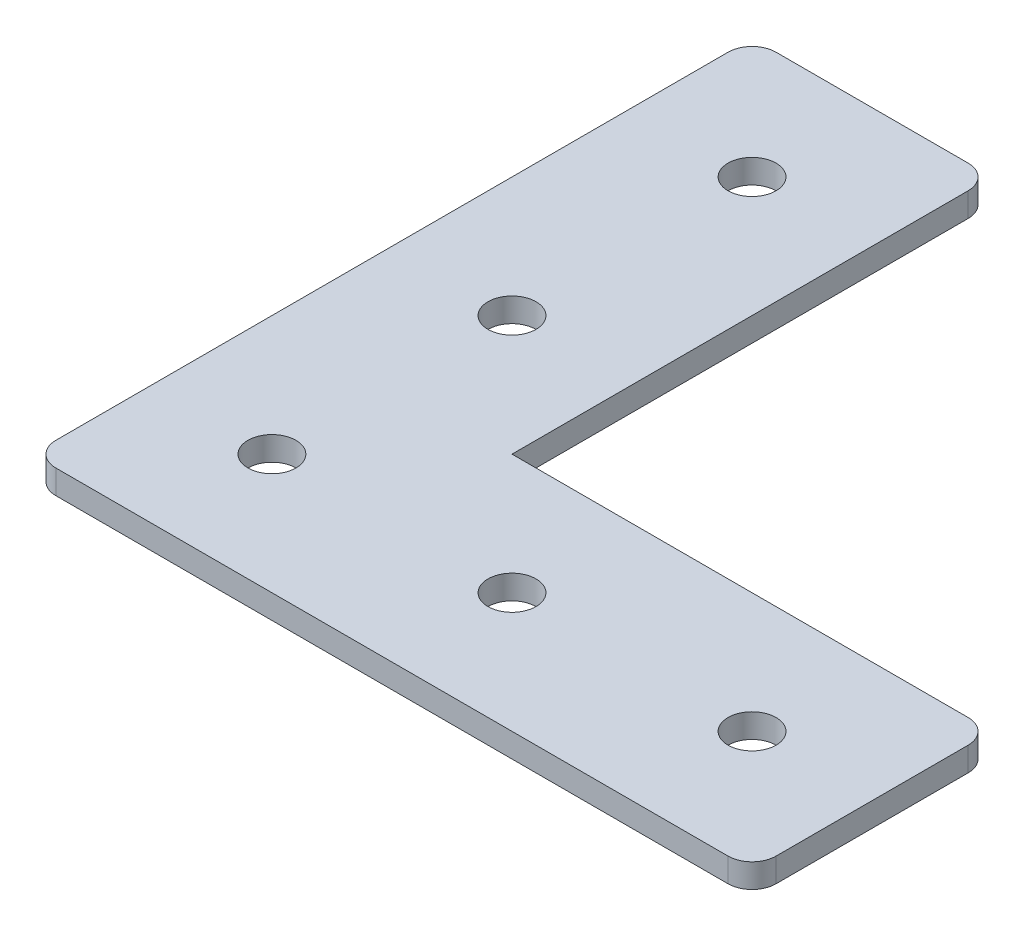
ISO-10303-21;
HEADER;
FILE_DESCRIPTION(('STEP AP214'),'2;1');
FILE_NAME('part.step','',(''),(''),'','','');
FILE_SCHEMA(('AUTOMOTIVE_DESIGN { 1 0 10303 214 1 1 1 1 }'));
ENDSEC;
DATA;
#1=APPLICATION_CONTEXT('core data for automotive mechanical design processes');
#2=APPLICATION_PROTOCOL_DEFINITION('international standard','automotive_design',2000,#1);
#3=PRODUCT_CONTEXT('',#1,'mechanical');
#4=PRODUCT('Part','Part','',(#3));
#5=PRODUCT_RELATED_PRODUCT_CATEGORY('part','',(#4));
#6=PRODUCT_DEFINITION_FORMATION('','',#4);
#7=PRODUCT_DEFINITION_CONTEXT('part definition',#1,'design');
#8=PRODUCT_DEFINITION('design','',#6,#7);
#9=PRODUCT_DEFINITION_SHAPE('','',#8);
#10=(LENGTH_UNIT() NAMED_UNIT(*) SI_UNIT(.MILLI.,.METRE.));
#11=(NAMED_UNIT(*) PLANE_ANGLE_UNIT() SI_UNIT($,.RADIAN.));
#12=(NAMED_UNIT(*) SI_UNIT($,.STERADIAN.) SOLID_ANGLE_UNIT());
#13=UNCERTAINTY_MEASURE_WITH_UNIT(LENGTH_MEASURE(1.E-05),#10,'distance_accuracy_value','');
#14=(GEOMETRIC_REPRESENTATION_CONTEXT(3) GLOBAL_UNCERTAINTY_ASSIGNED_CONTEXT((#13)) GLOBAL_UNIT_ASSIGNED_CONTEXT((#10,
#11,#12)) REPRESENTATION_CONTEXT('',''));
#15=CARTESIAN_POINT('',(0.,0.,0.));
#16=DIRECTION('',(0.,0.,1.));
#17=DIRECTION('',(1.,0.,0.));
#18=AXIS2_PLACEMENT_3D('',#15,#16,#17);
#19=CARTESIAN_POINT('',(0.,2.54,0.));
#20=DIRECTION('',(0.,-1.,0.));
#21=DIRECTION('',(0.,0.,-1.));
#22=AXIS2_PLACEMENT_3D('',#19,#20,#21);
#23=PLANE('',#22);
#24=DIRECTION('',(0.,0.,1.));
#25=VECTOR('',#24,1.);
#26=CARTESIAN_POINT('',(0.,2.54,0.));
#27=LINE('',#26,#25);
#28=CARTESIAN_POINT('',(0.,2.54,-73.66));
#29=VERTEX_POINT('',#28);
#30=CARTESIAN_POINT('',(0.,2.54,-2.54));
#31=VERTEX_POINT('',#30);
#32=EDGE_CURVE('E177',#29,#31,#27,.T.);
#33=ORIENTED_EDGE('',*,*,#32,.T.);
#34=CARTESIAN_POINT('',(2.54,2.54,-2.54));
#35=DIRECTION('',(0.,-1.,0.));
#36=DIRECTION('',(0.,0.,-1.));
#37=AXIS2_PLACEMENT_3D('',#34,#35,#36);
#38=CIRCLE('',#37,2.54);
#39=CARTESIAN_POINT('',(2.54,2.54,0.));
#40=VERTEX_POINT('',#39);
#41=EDGE_CURVE('E217',#31,#40,#38,.F.);
#42=ORIENTED_EDGE('',*,*,#41,.T.);
#43=DIRECTION('',(1.,0.,0.));
#44=VECTOR('',#43,1.);
#45=CARTESIAN_POINT('',(0.,2.54,0.));
#46=LINE('',#45,#44);
#47=CARTESIAN_POINT('',(73.66,2.54,0.));
#48=VERTEX_POINT('',#47);
#49=EDGE_CURVE('E251',#40,#48,#46,.T.);
#50=ORIENTED_EDGE('',*,*,#49,.T.);
#51=CARTESIAN_POINT('',(73.66,2.54,-2.54));
#52=DIRECTION('',(0.,-1.,0.));
#53=DIRECTION('',(0.,0.,-1.));
#54=AXIS2_PLACEMENT_3D('',#51,#52,#53);
#55=CIRCLE('',#54,2.54);
#56=CARTESIAN_POINT('',(76.2,2.54,-2.54));
#57=VERTEX_POINT('',#56);
#58=EDGE_CURVE('E214',#48,#57,#55,.F.);
#59=ORIENTED_EDGE('',*,*,#58,.T.);
#60=DIRECTION('',(0.,0.,-1.));
#61=VECTOR('',#60,1.);
#62=CARTESIAN_POINT('',(76.2,2.54,0.));
#63=LINE('',#62,#61);
#64=CARTESIAN_POINT('',(76.2,2.54,-22.86));
#65=VERTEX_POINT('',#64);
#66=EDGE_CURVE('E135',#57,#65,#63,.T.);
#67=ORIENTED_EDGE('',*,*,#66,.T.);
#68=CARTESIAN_POINT('',(73.66,2.54,-22.86));
#69=DIRECTION('',(0.,-1.,0.));
#70=DIRECTION('',(0.,0.,-1.));
#71=AXIS2_PLACEMENT_3D('',#68,#69,#70);
#72=CIRCLE('',#71,2.54);
#73=CARTESIAN_POINT('',(73.66,2.54,-25.4));
#74=VERTEX_POINT('',#73);
#75=EDGE_CURVE('E130',#65,#74,#72,.F.);
#76=ORIENTED_EDGE('',*,*,#75,.T.);
#77=DIRECTION('',(-1.,0.,0.));
#78=VECTOR('',#77,1.);
#79=CARTESIAN_POINT('',(25.4,2.54,-25.4));
#80=LINE('',#79,#78);
#81=CARTESIAN_POINT('',(25.4,2.54,-25.4));
#82=VERTEX_POINT('',#81);
#83=EDGE_CURVE('E122',#74,#82,#80,.T.);
#84=ORIENTED_EDGE('',*,*,#83,.T.);
#85=DIRECTION('',(0.,0.,-1.));
#86=VECTOR('',#85,1.);
#87=CARTESIAN_POINT('',(25.4,2.54,-76.2));
#88=LINE('',#87,#86);
#89=CARTESIAN_POINT('',(25.4,2.54,-73.66));
#90=VERTEX_POINT('',#89);
#91=EDGE_CURVE('E127',#82,#90,#88,.T.);
#92=ORIENTED_EDGE('',*,*,#91,.T.);
#93=CARTESIAN_POINT('',(22.86,2.54,-73.66));
#94=DIRECTION('',(0.,-1.,0.));
#95=DIRECTION('',(0.,0.,-1.));
#96=AXIS2_PLACEMENT_3D('',#93,#94,#95);
#97=CIRCLE('',#96,2.54);
#98=CARTESIAN_POINT('',(22.86,2.54,-76.2));
#99=VERTEX_POINT('',#98);
#100=EDGE_CURVE('E62',#90,#99,#97,.F.);
#101=ORIENTED_EDGE('',*,*,#100,.T.);
#102=DIRECTION('',(-1.,0.,0.));
#103=VECTOR('',#102,1.);
#104=CARTESIAN_POINT('',(0.,2.54,-76.2));
#105=LINE('',#104,#103);
#106=CARTESIAN_POINT('',(2.54,2.54,-76.2));
#107=VERTEX_POINT('',#106);
#108=EDGE_CURVE('E147',#99,#107,#105,.T.);
#109=ORIENTED_EDGE('',*,*,#108,.T.);
#110=CARTESIAN_POINT('',(2.54,2.54,-73.66));
#111=DIRECTION('',(0.,-1.,0.));
#112=DIRECTION('',(0.,0.,-1.));
#113=AXIS2_PLACEMENT_3D('',#110,#111,#112);
#114=CIRCLE('',#113,2.54);
#115=EDGE_CURVE('E207',#107,#29,#114,.F.);
#116=ORIENTED_EDGE('',*,*,#115,.T.);
#117=EDGE_LOOP('',(#33,#42,#50,#59,#67,#76,#84,#92,#101,#109,#116));
#118=FACE_BOUND('',#117,.T.);
#119=CARTESIAN_POINT('',(12.7,2.54,-12.7));
#120=DIRECTION('',(0.,1.,0.));
#121=DIRECTION('',(0.,0.,1.));
#122=AXIS2_PLACEMENT_3D('',#119,#120,#121);
#123=CIRCLE('',#122,2.54);
#124=CARTESIAN_POINT('',(12.7,2.54,-10.16));
#125=VERTEX_POINT('',#124);
#126=EDGE_CURVE('E162',#125,#125,#123,.T.);
#127=ORIENTED_EDGE('',*,*,#126,.F.);
#128=EDGE_LOOP('',(#127));
#129=FACE_BOUND('',#128,.T.);
#130=CARTESIAN_POINT('',(38.1,2.54,-12.7));
#131=DIRECTION('',(0.,1.,0.));
#132=DIRECTION('',(0.,0.,1.));
#133=AXIS2_PLACEMENT_3D('',#130,#131,#132);
#134=CIRCLE('',#133,2.54);
#135=CARTESIAN_POINT('',(38.1,2.54,-10.16));
#136=VERTEX_POINT('',#135);
#137=EDGE_CURVE('E438',#136,#136,#134,.T.);
#138=ORIENTED_EDGE('',*,*,#137,.F.);
#139=EDGE_LOOP('',(#138));
#140=FACE_BOUND('',#139,.T.);
#141=CARTESIAN_POINT('',(63.5,2.54,-12.7));
#142=DIRECTION('',(0.,1.,0.));
#143=DIRECTION('',(0.,0.,1.));
#144=AXIS2_PLACEMENT_3D('',#141,#142,#143);
#145=CIRCLE('',#144,2.54000000000001);
#146=CARTESIAN_POINT('',(63.5,2.54,-10.16));
#147=VERTEX_POINT('',#146);
#148=EDGE_CURVE('E447',#147,#147,#145,.T.);
#149=ORIENTED_EDGE('',*,*,#148,.F.);
#150=EDGE_LOOP('',(#149));
#151=FACE_BOUND('',#150,.T.);
#152=CARTESIAN_POINT('',(12.7,2.54,-38.1));
#153=DIRECTION('',(0.,1.,0.));
#154=DIRECTION('',(0.,0.,1.));
#155=AXIS2_PLACEMENT_3D('',#152,#153,#154);
#156=CIRCLE('',#155,2.54);
#157=CARTESIAN_POINT('',(12.7,2.54,-35.56));
#158=VERTEX_POINT('',#157);
#159=EDGE_CURVE('E454',#158,#158,#156,.T.);
#160=ORIENTED_EDGE('',*,*,#159,.F.);
#161=EDGE_LOOP('',(#160));
#162=FACE_BOUND('',#161,.T.);
#163=CARTESIAN_POINT('',(12.7,2.54,-63.5));
#164=DIRECTION('',(0.,1.,0.));
#165=DIRECTION('',(0.,0.,1.));
#166=AXIS2_PLACEMENT_3D('',#163,#164,#165);
#167=CIRCLE('',#166,2.54);
#168=CARTESIAN_POINT('',(12.7,2.54,-60.96));
#169=VERTEX_POINT('',#168);
#170=EDGE_CURVE('E462',#169,#169,#167,.T.);
#171=ORIENTED_EDGE('',*,*,#170,.F.);
#172=EDGE_LOOP('',(#171));
#173=FACE_BOUND('',#172,.T.);
#174=ADVANCED_FACE('F39',(#118,#129,#140,#151,#162,#173),#23,.F.);
#175=CARTESIAN_POINT('',(0.,0.,0.));
#176=DIRECTION('',(0.,-1.,0.));
#177=DIRECTION('',(0.,0.,-1.));
#178=AXIS2_PLACEMENT_3D('',#175,#176,#177);
#179=PLANE('',#178);
#180=CARTESIAN_POINT('',(12.7,0.,-38.1));
#181=DIRECTION('',(0.,1.,0.));
#182=DIRECTION('',(0.,0.,1.));
#183=AXIS2_PLACEMENT_3D('',#180,#181,#182);
#184=CIRCLE('',#183,2.54);
#185=CARTESIAN_POINT('',(12.7,0.,-35.56));
#186=VERTEX_POINT('',#185);
#187=EDGE_CURVE('E458',#186,#186,#184,.T.);
#188=ORIENTED_EDGE('',*,*,#187,.T.);
#189=EDGE_LOOP('',(#188));
#190=FACE_BOUND('',#189,.T.);
#191=CARTESIAN_POINT('',(38.1,0.,-12.7));
#192=DIRECTION('',(0.,1.,0.));
#193=DIRECTION('',(0.,0.,1.));
#194=AXIS2_PLACEMENT_3D('',#191,#192,#193);
#195=CIRCLE('',#194,2.54);
#196=CARTESIAN_POINT('',(38.1,0.,-10.16));
#197=VERTEX_POINT('',#196);
#198=EDGE_CURVE('E442',#197,#197,#195,.T.);
#199=ORIENTED_EDGE('',*,*,#198,.T.);
#200=EDGE_LOOP('',(#199));
#201=FACE_BOUND('',#200,.T.);
#202=DIRECTION('',(1.,0.,0.));
#203=VECTOR('',#202,1.);
#204=CARTESIAN_POINT('',(0.,0.,0.));
#205=LINE('',#204,#203);
#206=CARTESIAN_POINT('',(2.54,0.,0.));
#207=VERTEX_POINT('',#206);
#208=CARTESIAN_POINT('',(73.66,0.,0.));
#209=VERTEX_POINT('',#208);
#210=EDGE_CURVE('E161',#207,#209,#205,.T.);
#211=ORIENTED_EDGE('',*,*,#210,.F.);
#212=CARTESIAN_POINT('',(2.54,0.,-2.54));
#213=DIRECTION('',(0.,-1.,0.));
#214=DIRECTION('',(0.,0.,-1.));
#215=AXIS2_PLACEMENT_3D('',#212,#213,#214);
#216=CIRCLE('',#215,2.54);
#217=CARTESIAN_POINT('',(0.,0.,-2.54));
#218=VERTEX_POINT('',#217);
#219=EDGE_CURVE('E197',#207,#218,#216,.T.);
#220=ORIENTED_EDGE('',*,*,#219,.T.);
#221=DIRECTION('',(0.,0.,1.));
#222=VECTOR('',#221,1.);
#223=CARTESIAN_POINT('',(0.,0.,0.));
#224=LINE('',#223,#222);
#225=CARTESIAN_POINT('',(0.,0.,-73.66));
#226=VERTEX_POINT('',#225);
#227=EDGE_CURVE('E157',#226,#218,#224,.T.);
#228=ORIENTED_EDGE('',*,*,#227,.F.);
#229=CARTESIAN_POINT('',(2.54,0.,-73.66));
#230=DIRECTION('',(0.,-1.,0.));
#231=DIRECTION('',(0.,0.,-1.));
#232=AXIS2_PLACEMENT_3D('',#229,#230,#231);
#233=CIRCLE('',#232,2.54);
#234=CARTESIAN_POINT('',(2.54,0.,-76.2));
#235=VERTEX_POINT('',#234);
#236=EDGE_CURVE('E185',#226,#235,#233,.T.);
#237=ORIENTED_EDGE('',*,*,#236,.T.);
#238=DIRECTION('',(-1.,0.,0.));
#239=VECTOR('',#238,1.);
#240=CARTESIAN_POINT('',(0.,0.,-76.2));
#241=LINE('',#240,#239);
#242=CARTESIAN_POINT('',(22.86,0.,-76.2));
#243=VERTEX_POINT('',#242);
#244=EDGE_CURVE('E175',#243,#235,#241,.T.);
#245=ORIENTED_EDGE('',*,*,#244,.F.);
#246=CARTESIAN_POINT('',(22.86,0.,-73.66));
#247=DIRECTION('',(0.,-1.,0.));
#248=DIRECTION('',(0.,0.,-1.));
#249=AXIS2_PLACEMENT_3D('',#246,#247,#248);
#250=CIRCLE('',#249,2.54);
#251=CARTESIAN_POINT('',(25.4,0.,-73.66));
#252=VERTEX_POINT('',#251);
#253=EDGE_CURVE('E188',#243,#252,#250,.T.);
#254=ORIENTED_EDGE('',*,*,#253,.T.);
#255=DIRECTION('',(0.,0.,-1.));
#256=VECTOR('',#255,1.);
#257=CARTESIAN_POINT('',(25.4,0.,-76.2));
#258=LINE('',#257,#256);
#259=CARTESIAN_POINT('',(25.4,0.,-25.4));
#260=VERTEX_POINT('',#259);
#261=EDGE_CURVE('E172',#260,#252,#258,.T.);
#262=ORIENTED_EDGE('',*,*,#261,.F.);
#263=DIRECTION('',(-1.,0.,0.));
#264=VECTOR('',#263,1.);
#265=CARTESIAN_POINT('',(25.4,0.,-25.4));
#266=LINE('',#265,#264);
#267=CARTESIAN_POINT('',(73.66,0.,-25.4));
#268=VERTEX_POINT('',#267);
#269=EDGE_CURVE('E141',#268,#260,#266,.T.);
#270=ORIENTED_EDGE('',*,*,#269,.F.);
#271=CARTESIAN_POINT('',(73.66,0.,-22.86));
#272=DIRECTION('',(0.,-1.,0.));
#273=DIRECTION('',(0.,0.,-1.));
#274=AXIS2_PLACEMENT_3D('',#271,#272,#273);
#275=CIRCLE('',#274,2.54);
#276=CARTESIAN_POINT('',(76.2,0.,-22.86));
#277=VERTEX_POINT('',#276);
#278=EDGE_CURVE('E191',#268,#277,#275,.T.);
#279=ORIENTED_EDGE('',*,*,#278,.T.);
#280=DIRECTION('',(0.,0.,-1.));
#281=VECTOR('',#280,1.);
#282=CARTESIAN_POINT('',(76.2,0.,0.));
#283=LINE('',#282,#281);
#284=CARTESIAN_POINT('',(76.2,0.,-2.54));
#285=VERTEX_POINT('',#284);
#286=EDGE_CURVE('E166',#285,#277,#283,.T.);
#287=ORIENTED_EDGE('',*,*,#286,.F.);
#288=CARTESIAN_POINT('',(73.66,0.,-2.54));
#289=DIRECTION('',(0.,-1.,0.));
#290=DIRECTION('',(0.,0.,-1.));
#291=AXIS2_PLACEMENT_3D('',#288,#289,#290);
#292=CIRCLE('',#291,2.54);
#293=EDGE_CURVE('E194',#285,#209,#292,.T.);
#294=ORIENTED_EDGE('',*,*,#293,.T.);
#295=EDGE_LOOP('',(#211,#220,#228,#237,#245,#254,#262,#270,#279,#287,#294));
#296=FACE_BOUND('',#295,.T.);
#297=CARTESIAN_POINT('',(12.7,0.,-12.7));
#298=DIRECTION('',(0.,1.,0.));
#299=DIRECTION('',(0.,0.,1.));
#300=AXIS2_PLACEMENT_3D('',#297,#298,#299);
#301=CIRCLE('',#300,2.54);
#302=CARTESIAN_POINT('',(12.7,0.,-10.16));
#303=VERTEX_POINT('',#302);
#304=EDGE_CURVE('E257',#303,#303,#301,.T.);
#305=ORIENTED_EDGE('',*,*,#304,.T.);
#306=EDGE_LOOP('',(#305));
#307=FACE_BOUND('',#306,.T.);
#308=CARTESIAN_POINT('',(63.5,0.,-12.7));
#309=DIRECTION('',(0.,1.,0.));
#310=DIRECTION('',(0.,0.,1.));
#311=AXIS2_PLACEMENT_3D('',#308,#309,#310);
#312=CIRCLE('',#311,2.54000000000001);
#313=CARTESIAN_POINT('',(63.5,0.,-10.16));
#314=VERTEX_POINT('',#313);
#315=EDGE_CURVE('E450',#314,#314,#312,.T.);
#316=ORIENTED_EDGE('',*,*,#315,.T.);
#317=EDGE_LOOP('',(#316));
#318=FACE_BOUND('',#317,.T.);
#319=CARTESIAN_POINT('',(12.7,0.,-63.5));
#320=DIRECTION('',(0.,1.,0.));
#321=DIRECTION('',(0.,0.,1.));
#322=AXIS2_PLACEMENT_3D('',#319,#320,#321);
#323=CIRCLE('',#322,2.54);
#324=CARTESIAN_POINT('',(12.7,0.,-60.96));
#325=VERTEX_POINT('',#324);
#326=EDGE_CURVE('E466',#325,#325,#323,.T.);
#327=ORIENTED_EDGE('',*,*,#326,.T.);
#328=EDGE_LOOP('',(#327));
#329=FACE_BOUND('',#328,.T.);
#330=ADVANCED_FACE('F239',(#190,#201,#296,#307,#318,#329),#179,.T.);
#331=CARTESIAN_POINT('',(0.,2.54,0.));
#332=DIRECTION('',(1.,0.,0.));
#333=DIRECTION('',(0.,0.,-1.));
#334=AXIS2_PLACEMENT_3D('',#331,#332,#333);
#335=PLANE('',#334);
#336=ORIENTED_EDGE('',*,*,#227,.T.);
#337=DIRECTION('',(0.,-1.,0.));
#338=VECTOR('',#337,1.);
#339=CARTESIAN_POINT('',(0.,2.54,-2.54));
#340=LINE('',#339,#338);
#341=EDGE_CURVE('E204',#218,#31,#340,.F.);
#342=ORIENTED_EDGE('',*,*,#341,.T.);
#343=ORIENTED_EDGE('',*,*,#32,.F.);
#344=DIRECTION('',(0.,-1.,0.));
#345=VECTOR('',#344,1.);
#346=CARTESIAN_POINT('',(0.,2.54,-73.66));
#347=LINE('',#346,#345);
#348=EDGE_CURVE('E200',#29,#226,#347,.T.);
#349=ORIENTED_EDGE('',*,*,#348,.T.);
#350=EDGE_LOOP('',(#336,#342,#343,#349));
#351=FACE_BOUND('',#350,.T.);
#352=ADVANCED_FACE('F247',(#351),#335,.F.);
#353=CARTESIAN_POINT('',(0.,2.54,0.));
#354=DIRECTION('',(0.,0.,-1.));
#355=DIRECTION('',(-1.,0.,0.));
#356=AXIS2_PLACEMENT_3D('',#353,#354,#355);
#357=PLANE('',#356);
#358=ORIENTED_EDGE('',*,*,#49,.F.);
#359=DIRECTION('',(0.,-1.,0.));
#360=VECTOR('',#359,1.);
#361=CARTESIAN_POINT('',(2.54,2.54,0.));
#362=LINE('',#361,#360);
#363=EDGE_CURVE('E181',#40,#207,#362,.T.);
#364=ORIENTED_EDGE('',*,*,#363,.T.);
#365=ORIENTED_EDGE('',*,*,#210,.T.);
#366=DIRECTION('',(0.,-1.,0.));
#367=VECTOR('',#366,1.);
#368=CARTESIAN_POINT('',(73.66,2.54,0.));
#369=LINE('',#368,#367);
#370=EDGE_CURVE('E146',#209,#48,#369,.F.);
#371=ORIENTED_EDGE('',*,*,#370,.T.);
#372=EDGE_LOOP('',(#358,#364,#365,#371));
#373=FACE_BOUND('',#372,.T.);
#374=ADVANCED_FACE('F296',(#373),#357,.F.);
#375=CARTESIAN_POINT('',(76.2,2.54,0.));
#376=DIRECTION('',(-1.,0.,0.));
#377=DIRECTION('',(0.,0.,1.));
#378=AXIS2_PLACEMENT_3D('',#375,#376,#377);
#379=PLANE('',#378);
#380=ORIENTED_EDGE('',*,*,#66,.F.);
#381=DIRECTION('',(0.,-1.,0.));
#382=VECTOR('',#381,1.);
#383=CARTESIAN_POINT('',(76.2,2.54,-2.54));
#384=LINE('',#383,#382);
#385=EDGE_CURVE('E223',#57,#285,#384,.T.);
#386=ORIENTED_EDGE('',*,*,#385,.T.);
#387=ORIENTED_EDGE('',*,*,#286,.T.);
#388=DIRECTION('',(0.,-1.,0.));
#389=VECTOR('',#388,1.);
#390=CARTESIAN_POINT('',(76.2,2.54,-22.86));
#391=LINE('',#390,#389);
#392=EDGE_CURVE('E220',#277,#65,#391,.F.);
#393=ORIENTED_EDGE('',*,*,#392,.T.);
#394=EDGE_LOOP('',(#380,#386,#387,#393));
#395=FACE_BOUND('',#394,.T.);
#396=ADVANCED_FACE('F293',(#395),#379,.F.);
#397=CARTESIAN_POINT('',(25.4,2.54,-25.4));
#398=DIRECTION('',(0.,0.,1.));
#399=DIRECTION('',(1.,0.,0.));
#400=AXIS2_PLACEMENT_3D('',#397,#398,#399);
#401=PLANE('',#400);
#402=ORIENTED_EDGE('',*,*,#83,.F.);
#403=DIRECTION('',(0.,-1.,0.));
#404=VECTOR('',#403,1.);
#405=CARTESIAN_POINT('',(73.66,2.54,-25.4));
#406=LINE('',#405,#404);
#407=EDGE_CURVE('E227',#74,#268,#406,.T.);
#408=ORIENTED_EDGE('',*,*,#407,.T.);
#409=ORIENTED_EDGE('',*,*,#269,.T.);
#410=DIRECTION('',(0.,-1.,0.));
#411=VECTOR('',#410,1.);
#412=CARTESIAN_POINT('',(25.4,2.54,-25.4));
#413=LINE('',#412,#411);
#414=EDGE_CURVE('E138',#82,#260,#413,.T.);
#415=ORIENTED_EDGE('',*,*,#414,.F.);
#416=EDGE_LOOP('',(#402,#408,#409,#415));
#417=FACE_BOUND('',#416,.T.);
#418=ADVANCED_FACE('F139',(#417),#401,.F.);
#419=CARTESIAN_POINT('',(25.4,2.54,-76.2));
#420=DIRECTION('',(-1.,0.,0.));
#421=DIRECTION('',(0.,0.,1.));
#422=AXIS2_PLACEMENT_3D('',#419,#420,#421);
#423=PLANE('',#422);
#424=ORIENTED_EDGE('',*,*,#261,.T.);
#425=DIRECTION('',(0.,-1.,0.));
#426=VECTOR('',#425,1.);
#427=CARTESIAN_POINT('',(25.4,2.54,-73.66));
#428=LINE('',#427,#426);
#429=EDGE_CURVE('E11',#252,#90,#428,.F.);
#430=ORIENTED_EDGE('',*,*,#429,.T.);
#431=ORIENTED_EDGE('',*,*,#91,.F.);
#432=ORIENTED_EDGE('',*,*,#414,.T.);
#433=EDGE_LOOP('',(#424,#430,#431,#432));
#434=FACE_BOUND('',#433,.T.);
#435=ADVANCED_FACE('F149',(#434),#423,.F.);
#436=CARTESIAN_POINT('',(0.,2.54,-76.2));
#437=DIRECTION('',(0.,0.,1.));
#438=DIRECTION('',(1.,0.,0.));
#439=AXIS2_PLACEMENT_3D('',#436,#437,#438);
#440=PLANE('',#439);
#441=ORIENTED_EDGE('',*,*,#108,.F.);
#442=DIRECTION('',(0.,-1.,0.));
#443=VECTOR('',#442,1.);
#444=CARTESIAN_POINT('',(22.86,2.54,-76.2));
#445=LINE('',#444,#443);
#446=EDGE_CURVE('E48',#99,#243,#445,.T.);
#447=ORIENTED_EDGE('',*,*,#446,.T.);
#448=ORIENTED_EDGE('',*,*,#244,.T.);
#449=DIRECTION('',(0.,-1.,0.));
#450=VECTOR('',#449,1.);
#451=CARTESIAN_POINT('',(2.54,2.54,-76.2));
#452=LINE('',#451,#450);
#453=EDGE_CURVE('E55',#235,#107,#452,.F.);
#454=ORIENTED_EDGE('',*,*,#453,.T.);
#455=EDGE_LOOP('',(#441,#447,#448,#454));
#456=FACE_BOUND('',#455,.T.);
#457=ADVANCED_FACE('F235',(#456),#440,.F.);
#458=CARTESIAN_POINT('',(12.7,2.54,-12.7));
#459=DIRECTION('',(0.,-1.,0.));
#460=DIRECTION('',(0.,0.,-1.));
#461=AXIS2_PLACEMENT_3D('',#458,#459,#460);
#462=CYLINDRICAL_SURFACE('',#461,2.54);
#463=ORIENTED_EDGE('',*,*,#126,.T.);
#464=EDGE_LOOP('',(#463));
#465=FACE_BOUND('',#464,.T.);
#466=ORIENTED_EDGE('',*,*,#304,.F.);
#467=EDGE_LOOP('',(#466));
#468=FACE_BOUND('',#467,.T.);
#469=ADVANCED_FACE('F284',(#465,#468),#462,.F.);
#470=CARTESIAN_POINT('',(38.1,2.54,-12.7));
#471=DIRECTION('',(0.,-1.,0.));
#472=DIRECTION('',(0.,0.,-1.));
#473=AXIS2_PLACEMENT_3D('',#470,#471,#472);
#474=CYLINDRICAL_SURFACE('',#473,2.54);
#475=ORIENTED_EDGE('',*,*,#137,.T.);
#476=EDGE_LOOP('',(#475));
#477=FACE_BOUND('',#476,.T.);
#478=ORIENTED_EDGE('',*,*,#198,.F.);
#479=EDGE_LOOP('',(#478));
#480=FACE_BOUND('',#479,.T.);
#481=ADVANCED_FACE('F365',(#477,#480),#474,.F.);
#482=CARTESIAN_POINT('',(63.5,2.54,-12.7));
#483=DIRECTION('',(0.,-1.,0.));
#484=DIRECTION('',(0.,0.,-1.));
#485=AXIS2_PLACEMENT_3D('',#482,#483,#484);
#486=CYLINDRICAL_SURFACE('',#485,2.54000000000001);
#487=ORIENTED_EDGE('',*,*,#148,.T.);
#488=EDGE_LOOP('',(#487));
#489=FACE_BOUND('',#488,.T.);
#490=ORIENTED_EDGE('',*,*,#315,.F.);
#491=EDGE_LOOP('',(#490));
#492=FACE_BOUND('',#491,.T.);
#493=ADVANCED_FACE('F356',(#489,#492),#486,.F.);
#494=CARTESIAN_POINT('',(12.7,2.54,-38.1));
#495=DIRECTION('',(0.,-1.,0.));
#496=DIRECTION('',(0.,0.,-1.));
#497=AXIS2_PLACEMENT_3D('',#494,#495,#496);
#498=CYLINDRICAL_SURFACE('',#497,2.54);
#499=ORIENTED_EDGE('',*,*,#159,.T.);
#500=EDGE_LOOP('',(#499));
#501=FACE_BOUND('',#500,.T.);
#502=ORIENTED_EDGE('',*,*,#187,.F.);
#503=EDGE_LOOP('',(#502));
#504=FACE_BOUND('',#503,.T.);
#505=ADVANCED_FACE('F347',(#501,#504),#498,.F.);
#506=CARTESIAN_POINT('',(12.7,2.54,-63.5));
#507=DIRECTION('',(0.,-1.,0.));
#508=DIRECTION('',(0.,0.,-1.));
#509=AXIS2_PLACEMENT_3D('',#506,#507,#508);
#510=CYLINDRICAL_SURFACE('',#509,2.54);
#511=ORIENTED_EDGE('',*,*,#170,.T.);
#512=EDGE_LOOP('',(#511));
#513=FACE_BOUND('',#512,.T.);
#514=ORIENTED_EDGE('',*,*,#326,.F.);
#515=EDGE_LOOP('',(#514));
#516=FACE_BOUND('',#515,.T.);
#517=ADVANCED_FACE('F305',(#513,#516),#510,.F.);
#518=CARTESIAN_POINT('',(2.54,2.54,-2.54));
#519=DIRECTION('',(0.,-1.,0.));
#520=DIRECTION('',(0.,0.,-1.));
#521=AXIS2_PLACEMENT_3D('',#518,#519,#520);
#522=CYLINDRICAL_SURFACE('',#521,2.54);
#523=ORIENTED_EDGE('',*,*,#41,.F.);
#524=ORIENTED_EDGE('',*,*,#341,.F.);
#525=ORIENTED_EDGE('',*,*,#219,.F.);
#526=ORIENTED_EDGE('',*,*,#363,.F.);
#527=EDGE_LOOP('',(#523,#524,#525,#526));
#528=FACE_BOUND('',#527,.T.);
#529=ADVANCED_FACE('F302',(#528),#522,.T.);
#530=CARTESIAN_POINT('',(73.66,2.54,-2.54));
#531=DIRECTION('',(0.,-1.,0.));
#532=DIRECTION('',(0.,0.,-1.));
#533=AXIS2_PLACEMENT_3D('',#530,#531,#532);
#534=CYLINDRICAL_SURFACE('',#533,2.54);
#535=ORIENTED_EDGE('',*,*,#58,.F.);
#536=ORIENTED_EDGE('',*,*,#370,.F.);
#537=ORIENTED_EDGE('',*,*,#293,.F.);
#538=ORIENTED_EDGE('',*,*,#385,.F.);
#539=EDGE_LOOP('',(#535,#536,#537,#538));
#540=FACE_BOUND('',#539,.T.);
#541=ADVANCED_FACE('F274',(#540),#534,.T.);
#542=CARTESIAN_POINT('',(73.66,2.54,-22.86));
#543=DIRECTION('',(0.,-1.,0.));
#544=DIRECTION('',(0.,0.,-1.));
#545=AXIS2_PLACEMENT_3D('',#542,#543,#544);
#546=CYLINDRICAL_SURFACE('',#545,2.54);
#547=ORIENTED_EDGE('',*,*,#75,.F.);
#548=ORIENTED_EDGE('',*,*,#392,.F.);
#549=ORIENTED_EDGE('',*,*,#278,.F.);
#550=ORIENTED_EDGE('',*,*,#407,.F.);
#551=EDGE_LOOP('',(#547,#548,#549,#550));
#552=FACE_BOUND('',#551,.T.);
#553=ADVANCED_FACE('F266',(#552),#546,.T.);
#554=CARTESIAN_POINT('',(22.86,2.54,-73.66));
#555=DIRECTION('',(0.,-1.,0.));
#556=DIRECTION('',(0.,0.,-1.));
#557=AXIS2_PLACEMENT_3D('',#554,#555,#556);
#558=CYLINDRICAL_SURFACE('',#557,2.54);
#559=ORIENTED_EDGE('',*,*,#100,.F.);
#560=ORIENTED_EDGE('',*,*,#429,.F.);
#561=ORIENTED_EDGE('',*,*,#253,.F.);
#562=ORIENTED_EDGE('',*,*,#446,.F.);
#563=EDGE_LOOP('',(#559,#560,#561,#562));
#564=FACE_BOUND('',#563,.T.);
#565=ADVANCED_FACE('F268',(#564),#558,.T.);
#566=CARTESIAN_POINT('',(2.54,2.54,-73.66));
#567=DIRECTION('',(0.,-1.,0.));
#568=DIRECTION('',(0.,0.,-1.));
#569=AXIS2_PLACEMENT_3D('',#566,#567,#568);
#570=CYLINDRICAL_SURFACE('',#569,2.54);
#571=ORIENTED_EDGE('',*,*,#115,.F.);
#572=ORIENTED_EDGE('',*,*,#453,.F.);
#573=ORIENTED_EDGE('',*,*,#236,.F.);
#574=ORIENTED_EDGE('',*,*,#348,.F.);
#575=EDGE_LOOP('',(#571,#572,#573,#574));
#576=FACE_BOUND('',#575,.T.);
#577=ADVANCED_FACE('F41',(#576),#570,.T.);
#578=CLOSED_SHELL('',(#174,#330,#352,#374,#396,#418,#435,#457,#469,#481,#493,#505,#517,#529,
#541,#553,#565,#577));
#579=MANIFOLD_SOLID_BREP('B2',#578);
#580=ADVANCED_BREP_SHAPE_REPRESENTATION('',(#18,#579),#14);
#581=SHAPE_DEFINITION_REPRESENTATION(#9,#580);
ENDSEC;
END-ISO-10303-21;
